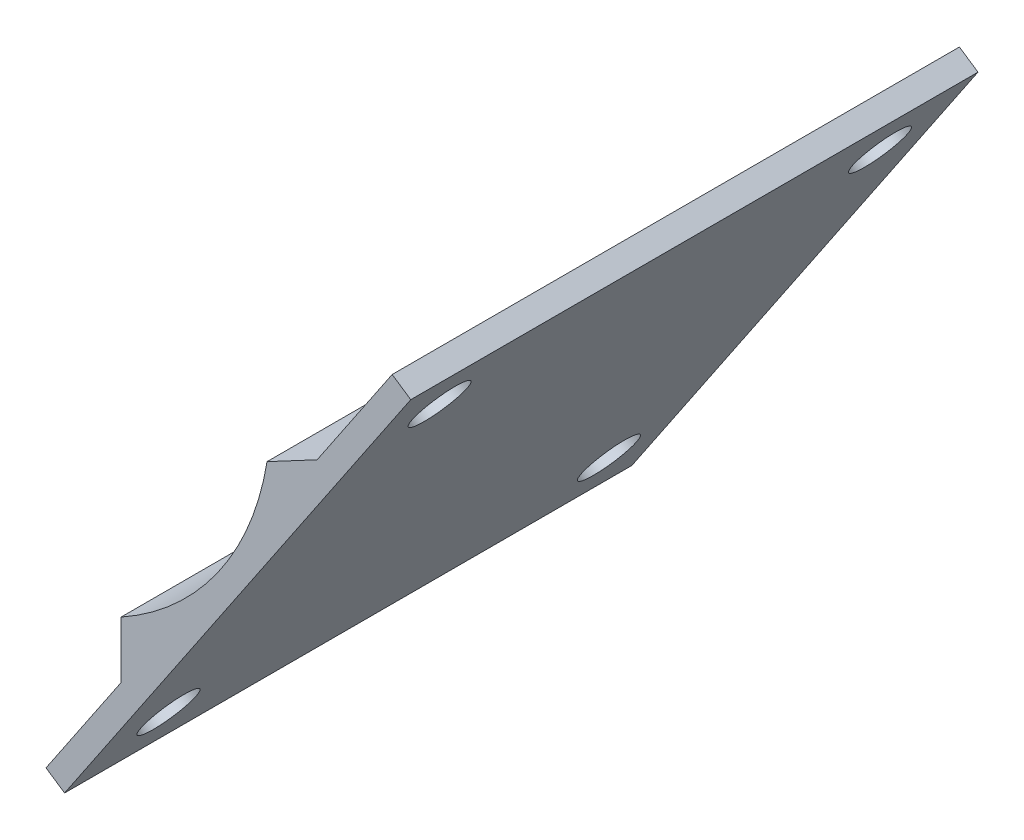
ISO-10303-21;
HEADER;
FILE_DESCRIPTION(('STEP AP214'),'2;1');
FILE_NAME('part.step','',(''),(''),'','','');
FILE_SCHEMA(('AUTOMOTIVE_DESIGN { 1 0 10303 214 1 1 1 1 }'));
ENDSEC;
DATA;
#1=APPLICATION_CONTEXT('core data for automotive mechanical design processes');
#2=APPLICATION_PROTOCOL_DEFINITION('international standard','automotive_design',2000,#1);
#3=PRODUCT_CONTEXT('',#1,'mechanical');
#4=PRODUCT('Part','Part','',(#3));
#5=PRODUCT_RELATED_PRODUCT_CATEGORY('part','',(#4));
#6=PRODUCT_DEFINITION_FORMATION('','',#4);
#7=PRODUCT_DEFINITION_CONTEXT('part definition',#1,'design');
#8=PRODUCT_DEFINITION('design','',#6,#7);
#9=PRODUCT_DEFINITION_SHAPE('','',#8);
#10=(LENGTH_UNIT() NAMED_UNIT(*) SI_UNIT(.MILLI.,.METRE.));
#11=(NAMED_UNIT(*) PLANE_ANGLE_UNIT() SI_UNIT($,.RADIAN.));
#12=(NAMED_UNIT(*) SI_UNIT($,.STERADIAN.) SOLID_ANGLE_UNIT());
#13=UNCERTAINTY_MEASURE_WITH_UNIT(LENGTH_MEASURE(1.E-05),#10,'distance_accuracy_value','');
#14=(GEOMETRIC_REPRESENTATION_CONTEXT(3) GLOBAL_UNCERTAINTY_ASSIGNED_CONTEXT((#13)) GLOBAL_UNIT_ASSIGNED_CONTEXT((#10,
#11,#12)) REPRESENTATION_CONTEXT('',''));
#15=CARTESIAN_POINT('',(0.,0.,0.));
#16=DIRECTION('',(0.,0.,1.));
#17=DIRECTION('',(1.,0.,0.));
#18=AXIS2_PLACEMENT_3D('',#15,#16,#17);
#19=CARTESIAN_POINT('',(0.,0.,38.));
#20=DIRECTION('',(0.,0.,-1.));
#21=DIRECTION('',(-1.,0.,0.));
#22=AXIS2_PLACEMENT_3D('',#19,#20,#21);
#23=CYLINDRICAL_SURFACE('',#22,19.5);
#24=CARTESIAN_POINT('',(0.,0.,0.));
#25=DIRECTION('',(0.,0.,-1.));
#26=DIRECTION('',(1.,0.,0.));
#27=AXIS2_PLACEMENT_3D('',#24,#25,#26);
#28=CIRCLE('',#27,19.5);
#29=CARTESIAN_POINT('',(19.2453747473745,-3.1409474419547,0.));
#30=VERTEX_POINT('',#29);
#31=CARTESIAN_POINT('',(9.46745359772662,-17.0475019394307,0.));
#32=VERTEX_POINT('',#31);
#33=EDGE_CURVE('E132',#30,#32,#28,.T.);
#34=ORIENTED_EDGE('',*,*,#33,.T.);
#35=DIRECTION('',(0.,0.,-1.));
#36=VECTOR('',#35,1.);
#37=CARTESIAN_POINT('',(9.46745359772662,-17.0475019394307,38.));
#38=LINE('',#37,#36);
#39=CARTESIAN_POINT('',(9.46745359772662,-17.0475019394307,38.));
#40=VERTEX_POINT('',#39);
#41=EDGE_CURVE('E11',#40,#32,#38,.T.);
#42=ORIENTED_EDGE('',*,*,#41,.F.);
#43=CARTESIAN_POINT('',(0.,0.,38.));
#44=DIRECTION('',(0.,0.,-1.));
#45=DIRECTION('',(1.,0.,0.));
#46=AXIS2_PLACEMENT_3D('',#43,#44,#45);
#47=CIRCLE('',#46,19.5);
#48=CARTESIAN_POINT('',(19.2453747473745,-3.1409474419547,38.));
#49=VERTEX_POINT('',#48);
#50=EDGE_CURVE('E146',#49,#40,#47,.T.);
#51=ORIENTED_EDGE('',*,*,#50,.F.);
#52=DIRECTION('',(0.,0.,-1.));
#53=VECTOR('',#52,1.);
#54=CARTESIAN_POINT('',(19.2453747473745,-3.1409474419547,38.));
#55=LINE('',#54,#53);
#56=EDGE_CURVE('E128',#49,#30,#55,.T.);
#57=ORIENTED_EDGE('',*,*,#56,.T.);
#58=EDGE_LOOP('',(#34,#42,#51,#57));
#59=FACE_BOUND('',#58,.T.);
#60=ADVANCED_FACE('F34',(#59),#23,.F.);
#61=CARTESIAN_POINT('',(9.46745359772662,-20.8460062803686,38.));
#62=DIRECTION('',(1.,0.,0.));
#63=DIRECTION('',(0.,0.,-1.));
#64=AXIS2_PLACEMENT_3D('',#61,#62,#63);
#65=PLANE('',#64);
#66=DIRECTION('',(0.,-1.,0.));
#67=VECTOR('',#66,1.);
#68=CARTESIAN_POINT('',(9.46745359772662,-20.8460062803686,0.));
#69=LINE('',#68,#67);
#70=CARTESIAN_POINT('',(9.46745359772662,-20.8460062803686,0.));
#71=VERTEX_POINT('',#70);
#72=EDGE_CURVE('E135',#32,#71,#69,.T.);
#73=ORIENTED_EDGE('',*,*,#72,.T.);
#74=DIRECTION('',(0.,0.,-1.));
#75=VECTOR('',#74,1.);
#76=CARTESIAN_POINT('',(9.46745359772662,-20.8460062803686,38.));
#77=LINE('',#76,#75);
#78=CARTESIAN_POINT('',(9.46745359772662,-20.8460062803686,38.));
#79=VERTEX_POINT('',#78);
#80=EDGE_CURVE('E43',#79,#71,#77,.T.);
#81=ORIENTED_EDGE('',*,*,#80,.F.);
#82=DIRECTION('',(0.,-1.,0.));
#83=VECTOR('',#82,1.);
#84=CARTESIAN_POINT('',(9.46745359772662,-20.8460062803686,38.));
#85=LINE('',#84,#83);
#86=EDGE_CURVE('E95',#40,#79,#85,.T.);
#87=ORIENTED_EDGE('',*,*,#86,.F.);
#88=ORIENTED_EDGE('',*,*,#41,.T.);
#89=EDGE_LOOP('',(#73,#81,#87,#88));
#90=FACE_BOUND('',#89,.T.);
#91=ADVANCED_FACE('F207',(#90),#65,.F.);
#92=CARTESIAN_POINT('',(4.43833497686936,-28.3097831994188,38.));
#93=DIRECTION('',(0.829308546561135,-0.558790957873029,0.));
#94=DIRECTION('',(0.558790957873029,0.829308546561135,0.));
#95=AXIS2_PLACEMENT_3D('',#92,#93,#94);
#96=PLANE('',#95);
#97=CARTESIAN_POINT('',(6.952894287298,-24.5778947398937,4.05));
#98=DIRECTION('',(-0.829308546561135,0.558790957873029,0.));
#99=DIRECTION('',(-0.558790957873029,-0.829308546561135,0.));
#100=AXIS2_PLACEMENT_3D('',#97,#98,#99);
#101=CIRCLE('',#100,1.85);
#102=CARTESIAN_POINT('',(5.91913101523289,-26.1121155510318,4.05));
#103=VERTEX_POINT('',#102);
#104=EDGE_CURVE('E321',#103,#103,#101,.T.);
#105=ORIENTED_EDGE('',*,*,#104,.F.);
#106=EDGE_LOOP('',(#105));
#107=FACE_BOUND('',#106,.T.);
#108=CARTESIAN_POINT('',(6.952894287298,-24.5778947398937,33.55));
#109=DIRECTION('',(-0.829308546561135,0.558790957873029,0.));
#110=DIRECTION('',(-0.558790957873029,-0.829308546561135,0.));
#111=AXIS2_PLACEMENT_3D('',#108,#109,#110);
#112=CIRCLE('',#111,1.85);
#113=CARTESIAN_POINT('',(5.91913101523289,-26.1121155510318,33.55));
#114=VERTEX_POINT('',#113);
#115=EDGE_CURVE('E328',#114,#114,#112,.T.);
#116=ORIENTED_EDGE('',*,*,#115,.F.);
#117=EDGE_LOOP('',(#116));
#118=FACE_BOUND('',#117,.T.);
#119=DIRECTION('',(-0.558790957873029,-0.829308546561135,0.));
#120=VECTOR('',#119,1.);
#121=CARTESIAN_POINT('',(4.43833497686936,-28.3097831994188,0.));
#122=LINE('',#121,#120);
#123=CARTESIAN_POINT('',(4.43833497686936,-28.3097831994188,0.));
#124=VERTEX_POINT('',#123);
#125=EDGE_CURVE('E137',#71,#124,#122,.T.);
#126=ORIENTED_EDGE('',*,*,#125,.T.);
#127=DIRECTION('',(0.,0.,-1.));
#128=VECTOR('',#127,1.);
#129=CARTESIAN_POINT('',(4.43833497686936,-28.3097831994188,38.));
#130=LINE('',#129,#128);
#131=CARTESIAN_POINT('',(4.43833497686936,-28.3097831994188,38.));
#132=VERTEX_POINT('',#131);
#133=EDGE_CURVE('E153',#132,#124,#130,.T.);
#134=ORIENTED_EDGE('',*,*,#133,.F.);
#135=DIRECTION('',(-0.558790957873029,-0.829308546561135,0.));
#136=VECTOR('',#135,1.);
#137=CARTESIAN_POINT('',(4.43833497686936,-28.3097831994188,38.));
#138=LINE('',#137,#136);
#139=EDGE_CURVE('E175',#79,#132,#138,.T.);
#140=ORIENTED_EDGE('',*,*,#139,.F.);
#141=ORIENTED_EDGE('',*,*,#80,.T.);
#142=EDGE_LOOP('',(#126,#134,#140,#141));
#143=FACE_BOUND('',#142,.T.);
#144=ADVANCED_FACE('F211',(#107,#118,#143),#96,.F.);
#145=CARTESIAN_POINT('',(5.68229779671106,-29.1479696362284,38.));
#146=DIRECTION('',(0.55879095787303,0.829308546561135,0.));
#147=DIRECTION('',(-0.829308546561135,0.55879095787303,0.));
#148=AXIS2_PLACEMENT_3D('',#145,#146,#147);
#149=PLANE('',#148);
#150=DIRECTION('',(0.829308546561135,-0.55879095787303,0.));
#151=VECTOR('',#150,1.);
#152=CARTESIAN_POINT('',(5.68229779671106,-29.1479696362284,0.));
#153=LINE('',#152,#151);
#154=CARTESIAN_POINT('',(5.68229779671106,-29.1479696362284,0.));
#155=VERTEX_POINT('',#154);
#156=EDGE_CURVE('E139',#124,#155,#153,.T.);
#157=ORIENTED_EDGE('',*,*,#156,.T.);
#158=DIRECTION('',(0.,0.,-1.));
#159=VECTOR('',#158,1.);
#160=CARTESIAN_POINT('',(5.68229779671106,-29.1479696362284,38.));
#161=LINE('',#160,#159);
#162=CARTESIAN_POINT('',(5.68229779671106,-29.1479696362284,38.));
#163=VERTEX_POINT('',#162);
#164=EDGE_CURVE('E150',#163,#155,#161,.T.);
#165=ORIENTED_EDGE('',*,*,#164,.F.);
#166=DIRECTION('',(0.829308546561135,-0.55879095787303,0.));
#167=VECTOR('',#166,1.);
#168=CARTESIAN_POINT('',(5.68229779671106,-29.1479696362284,38.));
#169=LINE('',#168,#167);
#170=EDGE_CURVE('E177',#132,#163,#169,.T.);
#171=ORIENTED_EDGE('',*,*,#170,.F.);
#172=ORIENTED_EDGE('',*,*,#133,.T.);
#173=EDGE_LOOP('',(#157,#165,#171,#172));
#174=FACE_BOUND('',#173,.T.);
#175=ADVANCED_FACE('F183',(#174),#149,.F.);
#176=CARTESIAN_POINT('',(28.8721225484418,5.26833504605876,38.));
#177=DIRECTION('',(-0.829308546561135,0.558790957873029,0.));
#178=DIRECTION('',(-0.558790957873029,-0.829308546561135,0.));
#179=AXIS2_PLACEMENT_3D('',#176,#177,#178);
#180=PLANE('',#179);
#181=CARTESIAN_POINT('',(26.3575632380132,1.53644658653366,33.55));
#182=DIRECTION('',(-0.829308546561135,0.558790957873029,0.));
#183=DIRECTION('',(-0.558790957873029,-0.829308546561135,0.));
#184=AXIS2_PLACEMENT_3D('',#181,#182,#183);
#185=CIRCLE('',#184,1.85);
#186=CARTESIAN_POINT('',(25.323799965948,0.00222577539555897,33.55));
#187=VERTEX_POINT('',#186);
#188=EDGE_CURVE('E159',#187,#187,#185,.T.);
#189=ORIENTED_EDGE('',*,*,#188,.T.);
#190=EDGE_LOOP('',(#189));
#191=FACE_BOUND('',#190,.T.);
#192=CARTESIAN_POINT('',(8.19685710713969,-25.4160811767033,4.05));
#193=DIRECTION('',(-0.829308546561135,0.558790957873029,0.));
#194=DIRECTION('',(-0.558790957873029,-0.829308546561135,0.));
#195=AXIS2_PLACEMENT_3D('',#192,#193,#194);
#196=CIRCLE('',#195,1.85);
#197=CARTESIAN_POINT('',(7.16309383507459,-26.9503019878414,4.05));
#198=VERTEX_POINT('',#197);
#199=EDGE_CURVE('E37',#198,#198,#196,.T.);
#200=ORIENTED_EDGE('',*,*,#199,.T.);
#201=EDGE_LOOP('',(#200));
#202=FACE_BOUND('',#201,.T.);
#203=CARTESIAN_POINT('',(8.19685710713969,-25.4160811767033,33.55));
#204=DIRECTION('',(-0.829308546561135,0.558790957873029,0.));
#205=DIRECTION('',(-0.558790957873029,-0.829308546561135,0.));
#206=AXIS2_PLACEMENT_3D('',#203,#204,#205);
#207=CIRCLE('',#206,1.85);
#208=CARTESIAN_POINT('',(7.16309383507459,-26.9503019878414,33.55));
#209=VERTEX_POINT('',#208);
#210=EDGE_CURVE('E157',#209,#209,#207,.T.);
#211=ORIENTED_EDGE('',*,*,#210,.T.);
#212=EDGE_LOOP('',(#211));
#213=FACE_BOUND('',#212,.T.);
#214=CARTESIAN_POINT('',(26.3575632380132,1.53644658653366,4.05));
#215=DIRECTION('',(-0.829308546561135,0.558790957873029,0.));
#216=DIRECTION('',(-0.558790957873029,-0.829308546561135,0.));
#217=AXIS2_PLACEMENT_3D('',#214,#215,#216);
#218=CIRCLE('',#217,1.85);
#219=CARTESIAN_POINT('',(25.323799965948,0.0022257753955555,4.05));
#220=VERTEX_POINT('',#219);
#221=EDGE_CURVE('E164',#220,#220,#218,.T.);
#222=ORIENTED_EDGE('',*,*,#221,.T.);
#223=EDGE_LOOP('',(#222));
#224=FACE_BOUND('',#223,.T.);
#225=DIRECTION('',(0.558790957873029,0.829308546561135,0.));
#226=VECTOR('',#225,1.);
#227=CARTESIAN_POINT('',(28.8721225484418,5.26833504605876,0.));
#228=LINE('',#227,#226);
#229=CARTESIAN_POINT('',(28.8721225484418,5.26833504605876,0.));
#230=VERTEX_POINT('',#229);
#231=EDGE_CURVE('E141',#155,#230,#228,.T.);
#232=ORIENTED_EDGE('',*,*,#231,.T.);
#233=DIRECTION('',(0.,0.,-1.));
#234=VECTOR('',#233,1.);
#235=CARTESIAN_POINT('',(28.8721225484418,5.26833504605876,38.));
#236=LINE('',#235,#234);
#237=CARTESIAN_POINT('',(28.8721225484418,5.26833504605876,38.));
#238=VERTEX_POINT('',#237);
#239=EDGE_CURVE('E123',#238,#230,#236,.T.);
#240=ORIENTED_EDGE('',*,*,#239,.F.);
#241=DIRECTION('',(0.558790957873029,0.829308546561135,0.));
#242=VECTOR('',#241,1.);
#243=CARTESIAN_POINT('',(28.8721225484418,5.26833504605876,38.));
#244=LINE('',#243,#242);
#245=EDGE_CURVE('E114',#163,#238,#244,.T.);
#246=ORIENTED_EDGE('',*,*,#245,.F.);
#247=ORIENTED_EDGE('',*,*,#164,.T.);
#248=EDGE_LOOP('',(#232,#240,#246,#247));
#249=FACE_BOUND('',#248,.T.);
#250=ADVANCED_FACE('F187',(#191,#202,#213,#224,#249),#180,.F.);
#251=CARTESIAN_POINT('',(27.6281597286001,6.10652148286831,38.));
#252=DIRECTION('',(-0.558790957873029,-0.829308546561135,0.));
#253=DIRECTION('',(0.829308546561135,-0.558790957873029,0.));
#254=AXIS2_PLACEMENT_3D('',#251,#252,#253);
#255=PLANE('',#254);
#256=DIRECTION('',(-0.829308546561135,0.558790957873029,0.));
#257=VECTOR('',#256,1.);
#258=CARTESIAN_POINT('',(27.6281597286001,6.10652148286831,0.));
#259=LINE('',#258,#257);
#260=CARTESIAN_POINT('',(27.6281597286001,6.10652148286831,0.));
#261=VERTEX_POINT('',#260);
#262=EDGE_CURVE('E122',#230,#261,#259,.T.);
#263=ORIENTED_EDGE('',*,*,#262,.T.);
#264=DIRECTION('',(0.,0.,-1.));
#265=VECTOR('',#264,1.);
#266=CARTESIAN_POINT('',(27.6281597286001,6.10652148286831,38.));
#267=LINE('',#266,#265);
#268=CARTESIAN_POINT('',(27.6281597286001,6.10652148286831,38.));
#269=VERTEX_POINT('',#268);
#270=EDGE_CURVE('E119',#269,#261,#267,.T.);
#271=ORIENTED_EDGE('',*,*,#270,.F.);
#272=DIRECTION('',(-0.829308546561135,0.558790957873029,0.));
#273=VECTOR('',#272,1.);
#274=CARTESIAN_POINT('',(27.6281597286001,6.10652148286831,38.));
#275=LINE('',#274,#273);
#276=EDGE_CURVE('E108',#238,#269,#275,.T.);
#277=ORIENTED_EDGE('',*,*,#276,.F.);
#278=ORIENTED_EDGE('',*,*,#239,.T.);
#279=EDGE_LOOP('',(#263,#271,#277,#278));
#280=FACE_BOUND('',#279,.T.);
#281=ADVANCED_FACE('F120',(#280),#255,.F.);
#282=CARTESIAN_POINT('',(22.5990411077428,-1.35725543618191,38.));
#283=DIRECTION('',(0.829308546561135,-0.558790957873029,0.));
#284=DIRECTION('',(0.558790957873029,0.829308546561135,0.));
#285=AXIS2_PLACEMENT_3D('',#282,#283,#284);
#286=PLANE('',#285);
#287=CARTESIAN_POINT('',(25.1136004181715,2.37463302334319,33.55));
#288=DIRECTION('',(-0.829308546561135,0.558790957873029,0.));
#289=DIRECTION('',(-0.558790957873029,-0.829308546561135,0.));
#290=AXIS2_PLACEMENT_3D('',#287,#288,#289);
#291=CIRCLE('',#290,1.85);
#292=CARTESIAN_POINT('',(24.0798371461064,0.840412212205097,33.55));
#293=VERTEX_POINT('',#292);
#294=EDGE_CURVE('E327',#293,#293,#291,.T.);
#295=ORIENTED_EDGE('',*,*,#294,.F.);
#296=EDGE_LOOP('',(#295));
#297=FACE_BOUND('',#296,.T.);
#298=CARTESIAN_POINT('',(25.1136004181715,2.37463302334319,4.05));
#299=DIRECTION('',(-0.829308546561135,0.558790957873029,0.));
#300=DIRECTION('',(-0.558790957873029,-0.829308546561135,0.));
#301=AXIS2_PLACEMENT_3D('',#298,#299,#300);
#302=CIRCLE('',#301,1.85);
#303=CARTESIAN_POINT('',(24.0798371461064,0.840412212205093,4.05));
#304=VERTEX_POINT('',#303);
#305=EDGE_CURVE('E169',#304,#304,#302,.T.);
#306=ORIENTED_EDGE('',*,*,#305,.F.);
#307=EDGE_LOOP('',(#306));
#308=FACE_BOUND('',#307,.T.);
#309=DIRECTION('',(-0.558790957873029,-0.829308546561135,0.));
#310=VECTOR('',#309,1.);
#311=CARTESIAN_POINT('',(22.5990411077428,-1.35725543618191,0.));
#312=LINE('',#311,#310);
#313=CARTESIAN_POINT('',(22.5990411077428,-1.35725543618191,0.));
#314=VERTEX_POINT('',#313);
#315=EDGE_CURVE('E81',#261,#314,#312,.T.);
#316=ORIENTED_EDGE('',*,*,#315,.T.);
#317=DIRECTION('',(0.,0.,-1.));
#318=VECTOR('',#317,1.);
#319=CARTESIAN_POINT('',(22.5990411077428,-1.35725543618191,38.));
#320=LINE('',#319,#318);
#321=CARTESIAN_POINT('',(22.5990411077428,-1.35725543618191,38.));
#322=VERTEX_POINT('',#321);
#323=EDGE_CURVE('E124',#322,#314,#320,.T.);
#324=ORIENTED_EDGE('',*,*,#323,.F.);
#325=DIRECTION('',(-0.558790957873029,-0.829308546561135,0.));
#326=VECTOR('',#325,1.);
#327=CARTESIAN_POINT('',(22.5990411077428,-1.35725543618191,38.));
#328=LINE('',#327,#326);
#329=EDGE_CURVE('E112',#269,#322,#328,.T.);
#330=ORIENTED_EDGE('',*,*,#329,.F.);
#331=ORIENTED_EDGE('',*,*,#270,.T.);
#332=EDGE_LOOP('',(#316,#324,#330,#331));
#333=FACE_BOUND('',#332,.T.);
#334=ADVANCED_FACE('F126',(#297,#308,#333),#286,.F.);
#335=CARTESIAN_POINT('',(19.2453747473745,-3.1409474419547,38.));
#336=DIRECTION('',(0.469577456197503,-0.882891280187477,0.));
#337=DIRECTION('',(0.882891280187477,0.469577456197503,0.));
#338=AXIS2_PLACEMENT_3D('',#335,#336,#337);
#339=PLANE('',#338);
#340=DIRECTION('',(-0.882891280187477,-0.469577456197503,0.));
#341=VECTOR('',#340,1.);
#342=CARTESIAN_POINT('',(19.2453747473745,-3.1409474419547,0.));
#343=LINE('',#342,#341);
#344=EDGE_CURVE('E87',#314,#30,#343,.T.);
#345=ORIENTED_EDGE('',*,*,#344,.T.);
#346=ORIENTED_EDGE('',*,*,#56,.F.);
#347=DIRECTION('',(-0.882891280187477,-0.469577456197503,0.));
#348=VECTOR('',#347,1.);
#349=CARTESIAN_POINT('',(19.2453747473745,-3.1409474419547,38.));
#350=LINE('',#349,#348);
#351=EDGE_CURVE('E52',#322,#49,#350,.T.);
#352=ORIENTED_EDGE('',*,*,#351,.F.);
#353=ORIENTED_EDGE('',*,*,#323,.T.);
#354=EDGE_LOOP('',(#345,#346,#352,#353));
#355=FACE_BOUND('',#354,.T.);
#356=ADVANCED_FACE('F195',(#355),#339,.F.);
#357=CARTESIAN_POINT('',(0.,0.,38.));
#358=DIRECTION('',(0.,0.,1.));
#359=DIRECTION('',(1.,0.,0.));
#360=AXIS2_PLACEMENT_3D('',#357,#358,#359);
#361=PLANE('',#360);
#362=ORIENTED_EDGE('',*,*,#50,.T.);
#363=ORIENTED_EDGE('',*,*,#86,.T.);
#364=ORIENTED_EDGE('',*,*,#139,.T.);
#365=ORIENTED_EDGE('',*,*,#170,.T.);
#366=ORIENTED_EDGE('',*,*,#245,.T.);
#367=ORIENTED_EDGE('',*,*,#276,.T.);
#368=ORIENTED_EDGE('',*,*,#329,.T.);
#369=ORIENTED_EDGE('',*,*,#351,.T.);
#370=EDGE_LOOP('',(#362,#363,#364,#365,#366,#367,#368,#369));
#371=FACE_BOUND('',#370,.T.);
#372=ADVANCED_FACE('F110',(#371),#361,.T.);
#373=CARTESIAN_POINT('',(0.,0.,0.));
#374=DIRECTION('',(0.,0.,1.));
#375=DIRECTION('',(1.,0.,0.));
#376=AXIS2_PLACEMENT_3D('',#373,#374,#375);
#377=PLANE('',#376);
#378=ORIENTED_EDGE('',*,*,#33,.F.);
#379=ORIENTED_EDGE('',*,*,#344,.F.);
#380=ORIENTED_EDGE('',*,*,#315,.F.);
#381=ORIENTED_EDGE('',*,*,#262,.F.);
#382=ORIENTED_EDGE('',*,*,#231,.F.);
#383=ORIENTED_EDGE('',*,*,#156,.F.);
#384=ORIENTED_EDGE('',*,*,#125,.F.);
#385=ORIENTED_EDGE('',*,*,#72,.F.);
#386=EDGE_LOOP('',(#378,#379,#380,#381,#382,#383,#384,#385));
#387=FACE_BOUND('',#386,.T.);
#388=ADVANCED_FACE('F190',(#387),#377,.F.);
#389=CARTESIAN_POINT('',(42.3064270211596,-9.20995281731462,4.05));
#390=DIRECTION('',(-0.829308546561135,0.558790957873029,0.));
#391=DIRECTION('',(-0.558790957873029,-0.829308546561135,0.));
#392=AXIS2_PLACEMENT_3D('',#389,#390,#391);
#393=CYLINDRICAL_SURFACE('',#392,1.85);
#394=ORIENTED_EDGE('',*,*,#305,.T.);
#395=EDGE_LOOP('',(#394));
#396=FACE_BOUND('',#395,.T.);
#397=ORIENTED_EDGE('',*,*,#221,.F.);
#398=EDGE_LOOP('',(#397));
#399=FACE_BOUND('',#398,.T.);
#400=ADVANCED_FACE('F241',(#396,#399),#393,.F.);
#401=CARTESIAN_POINT('',(42.3064270211596,-9.20995281731462,33.55));
#402=DIRECTION('',(-0.829308546561135,0.558790957873029,0.));
#403=DIRECTION('',(-0.558790957873029,-0.829308546561135,0.));
#404=AXIS2_PLACEMENT_3D('',#401,#402,#403);
#405=CYLINDRICAL_SURFACE('',#404,1.85);
#406=ORIENTED_EDGE('',*,*,#294,.T.);
#407=EDGE_LOOP('',(#406));
#408=FACE_BOUND('',#407,.T.);
#409=ORIENTED_EDGE('',*,*,#188,.F.);
#410=EDGE_LOOP('',(#409));
#411=FACE_BOUND('',#410,.T.);
#412=ADVANCED_FACE('F246',(#408,#411),#405,.F.);
#413=CARTESIAN_POINT('',(24.1457208902861,-36.1624805805515,33.55));
#414=DIRECTION('',(-0.829308546561135,0.558790957873029,0.));
#415=DIRECTION('',(-0.558790957873029,-0.829308546561135,0.));
#416=AXIS2_PLACEMENT_3D('',#413,#414,#415);
#417=CYLINDRICAL_SURFACE('',#416,1.85);
#418=ORIENTED_EDGE('',*,*,#115,.T.);
#419=EDGE_LOOP('',(#418));
#420=FACE_BOUND('',#419,.T.);
#421=ORIENTED_EDGE('',*,*,#210,.F.);
#422=EDGE_LOOP('',(#421));
#423=FACE_BOUND('',#422,.T.);
#424=ADVANCED_FACE('F258',(#420,#423),#417,.F.);
#425=CARTESIAN_POINT('',(24.1457208902861,-36.1624805805515,4.05));
#426=DIRECTION('',(-0.829308546561135,0.558790957873029,0.));
#427=DIRECTION('',(-0.558790957873029,-0.829308546561135,0.));
#428=AXIS2_PLACEMENT_3D('',#425,#426,#427);
#429=CYLINDRICAL_SURFACE('',#428,1.85);
#430=ORIENTED_EDGE('',*,*,#104,.T.);
#431=EDGE_LOOP('',(#430));
#432=FACE_BOUND('',#431,.T.);
#433=ORIENTED_EDGE('',*,*,#199,.F.);
#434=EDGE_LOOP('',(#433));
#435=FACE_BOUND('',#434,.T.);
#436=ADVANCED_FACE('F268',(#432,#435),#429,.F.);
#437=CLOSED_SHELL('',(#60,#91,#144,#175,#250,#281,#334,#356,#372,#388,#400,#412,#424,#436));
#438=MANIFOLD_SOLID_BREP('B2',#437);
#439=ADVANCED_BREP_SHAPE_REPRESENTATION('',(#18,#438),#14);
#440=SHAPE_DEFINITION_REPRESENTATION(#9,#439);
ENDSEC;
END-ISO-10303-21;
